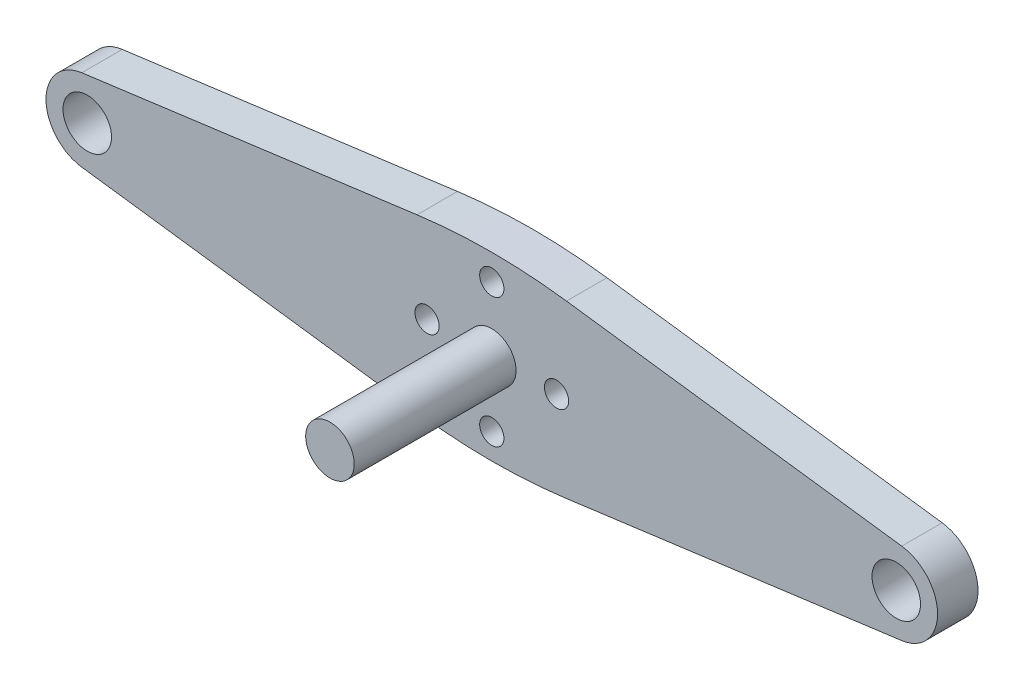
ISO-10303-21;
HEADER;
FILE_DESCRIPTION(('STEP AP214'),'2;1');
FILE_NAME('part.step','',(''),(''),'','','');
FILE_SCHEMA(('AUTOMOTIVE_DESIGN { 1 0 10303 214 1 1 1 1 }'));
ENDSEC;
DATA;
#1=APPLICATION_CONTEXT('core data for automotive mechanical design processes');
#2=APPLICATION_PROTOCOL_DEFINITION('international standard','automotive_design',2000,#1);
#3=PRODUCT_CONTEXT('',#1,'mechanical');
#4=PRODUCT('Part','Part','',(#3));
#5=PRODUCT_RELATED_PRODUCT_CATEGORY('part','',(#4));
#6=PRODUCT_DEFINITION_FORMATION('','',#4);
#7=PRODUCT_DEFINITION_CONTEXT('part definition',#1,'design');
#8=PRODUCT_DEFINITION('design','',#6,#7);
#9=PRODUCT_DEFINITION_SHAPE('','',#8);
#10=(LENGTH_UNIT() NAMED_UNIT(*) SI_UNIT(.MILLI.,.METRE.));
#11=(NAMED_UNIT(*) PLANE_ANGLE_UNIT() SI_UNIT($,.RADIAN.));
#12=(NAMED_UNIT(*) SI_UNIT($,.STERADIAN.) SOLID_ANGLE_UNIT());
#13=UNCERTAINTY_MEASURE_WITH_UNIT(LENGTH_MEASURE(1.E-05),#10,'distance_accuracy_value','');
#14=(GEOMETRIC_REPRESENTATION_CONTEXT(3) GLOBAL_UNCERTAINTY_ASSIGNED_CONTEXT((#13)) GLOBAL_UNIT_ASSIGNED_CONTEXT((#10,
#11,#12)) REPRESENTATION_CONTEXT('',''));
#15=CARTESIAN_POINT('',(0.,0.,0.));
#16=DIRECTION('',(0.,0.,1.));
#17=DIRECTION('',(1.,0.,0.));
#18=AXIS2_PLACEMENT_3D('',#15,#16,#17);
#19=CARTESIAN_POINT('',(50.,0.,5.));
#20=DIRECTION('',(0.,0.,-1.));
#21=DIRECTION('',(-1.,0.,0.));
#22=AXIS2_PLACEMENT_3D('',#19,#20,#21);
#23=PLANE('',#22);
#24=CARTESIAN_POINT('',(50.,0.,5.));
#25=DIRECTION('',(0.,0.,1.));
#26=DIRECTION('',(-1.,0.,0.));
#27=AXIS2_PLACEMENT_3D('',#24,#25,#26);
#28=CIRCLE('',#27,5.10024633771241);
#29=CARTESIAN_POINT('',(50.6728763500851,-5.05566515137672,5.));
#30=VERTEX_POINT('',#29);
#31=CARTESIAN_POINT('',(50.6728763500851,5.05566515137672,5.));
#32=VERTEX_POINT('',#31);
#33=EDGE_CURVE('E146',#30,#32,#28,.T.);
#34=ORIENTED_EDGE('',*,*,#33,.T.);
#35=DIRECTION('',(-0.991259013117456,0.131930166805804,0.));
#36=VECTOR('',#35,1.);
#37=CARTESIAN_POINT('',(50.6728763500851,5.05566515137672,5.));
#38=LINE('',#37,#36);
#39=CARTESIAN_POINT('',(9.2351116764065,10.5707637614413,5.));
#40=VERTEX_POINT('',#39);
#41=EDGE_CURVE('E94',#32,#40,#38,.T.);
#42=ORIENTED_EDGE('',*,*,#41,.T.);
#43=CARTESIAN_POINT('',(0.,-58.8173671567806,5.));
#44=DIRECTION('',(0.,0.,1.));
#45=DIRECTION('',(-1.,0.,0.));
#46=AXIS2_PLACEMENT_3D('',#43,#44,#45);
#47=CIRCLE('',#46,70.);
#48=CARTESIAN_POINT('',(-9.23511167640649,10.5707637614413,5.));
#49=VERTEX_POINT('',#48);
#50=EDGE_CURVE('E161',#40,#49,#47,.T.);
#51=ORIENTED_EDGE('',*,*,#50,.T.);
#52=DIRECTION('',(-0.991259013117456,-0.131930166805804,0.));
#53=VECTOR('',#52,1.);
#54=CARTESIAN_POINT('',(-50.6728763500851,5.05566515137672,5.));
#55=LINE('',#54,#53);
#56=CARTESIAN_POINT('',(-50.6728763500851,5.05566515137672,5.));
#57=VERTEX_POINT('',#56);
#58=EDGE_CURVE('E174',#49,#57,#55,.T.);
#59=ORIENTED_EDGE('',*,*,#58,.T.);
#60=CARTESIAN_POINT('',(-50.,0.,5.));
#61=DIRECTION('',(0.,0.,1.));
#62=DIRECTION('',(1.,0.,0.));
#63=AXIS2_PLACEMENT_3D('',#60,#61,#62);
#64=CIRCLE('',#63,5.10024633771241);
#65=CARTESIAN_POINT('',(-50.6728763500851,-5.05566515137672,5.));
#66=VERTEX_POINT('',#65);
#67=EDGE_CURVE('E113',#57,#66,#64,.T.);
#68=ORIENTED_EDGE('',*,*,#67,.T.);
#69=DIRECTION('',(0.991259013117456,-0.131930166805804,0.));
#70=VECTOR('',#69,1.);
#71=CARTESIAN_POINT('',(-50.6728763500851,-5.05566515137672,5.));
#72=LINE('',#71,#70);
#73=CARTESIAN_POINT('',(-9.23511167640653,-10.5707637614413,5.));
#74=VERTEX_POINT('',#73);
#75=EDGE_CURVE('E107',#66,#74,#72,.T.);
#76=ORIENTED_EDGE('',*,*,#75,.T.);
#77=CARTESIAN_POINT('',(0.,58.8173671567806,5.));
#78=DIRECTION('',(0.,0.,1.));
#79=DIRECTION('',(1.,0.,0.));
#80=AXIS2_PLACEMENT_3D('',#77,#78,#79);
#81=CIRCLE('',#80,70.);
#82=CARTESIAN_POINT('',(9.23511167640649,-10.5707637614413,5.));
#83=VERTEX_POINT('',#82);
#84=EDGE_CURVE('E111',#74,#83,#81,.T.);
#85=ORIENTED_EDGE('',*,*,#84,.T.);
#86=DIRECTION('',(0.991259013117456,0.131930166805804,0.));
#87=VECTOR('',#86,1.);
#88=CARTESIAN_POINT('',(50.6728763500851,-5.05566515137672,5.));
#89=LINE('',#88,#87);
#90=EDGE_CURVE('E51',#83,#30,#89,.T.);
#91=ORIENTED_EDGE('',*,*,#90,.T.);
#92=EDGE_LOOP('',(#34,#42,#51,#59,#68,#76,#85,#91));
#93=FACE_BOUND('',#92,.T.);
#94=CARTESIAN_POINT('',(0.,0.,5.));
#95=DIRECTION('',(0.,0.,1.));
#96=DIRECTION('',(1.,0.,0.));
#97=AXIS2_PLACEMENT_3D('',#94,#95,#96);
#98=CIRCLE('',#97,3.);
#99=CARTESIAN_POINT('',(3.,0.,5.));
#100=VERTEX_POINT('',#99);
#101=EDGE_CURVE('E135',#100,#100,#98,.T.);
#102=ORIENTED_EDGE('',*,*,#101,.F.);
#103=EDGE_LOOP('',(#102));
#104=FACE_BOUND('',#103,.T.);
#105=CARTESIAN_POINT('',(-8.,0.,5.));
#106=DIRECTION('',(0.,0.,1.));
#107=DIRECTION('',(1.,0.,0.));
#108=AXIS2_PLACEMENT_3D('',#105,#106,#107);
#109=CIRCLE('',#108,1.5);
#110=CARTESIAN_POINT('',(-6.5,0.,5.));
#111=VERTEX_POINT('',#110);
#112=EDGE_CURVE('E182',#111,#111,#109,.T.);
#113=ORIENTED_EDGE('',*,*,#112,.F.);
#114=EDGE_LOOP('',(#113));
#115=FACE_BOUND('',#114,.T.);
#116=CARTESIAN_POINT('',(-50.,0.,5.));
#117=DIRECTION('',(0.,0.,1.));
#118=DIRECTION('',(1.,0.,0.));
#119=AXIS2_PLACEMENT_3D('',#116,#117,#118);
#120=CIRCLE('',#119,3.);
#121=CARTESIAN_POINT('',(-47.,0.,5.));
#122=VERTEX_POINT('',#121);
#123=EDGE_CURVE('E186',#122,#122,#120,.T.);
#124=ORIENTED_EDGE('',*,*,#123,.F.);
#125=EDGE_LOOP('',(#124));
#126=FACE_BOUND('',#125,.T.);
#127=CARTESIAN_POINT('',(0.,8.,5.));
#128=DIRECTION('',(0.,0.,1.));
#129=DIRECTION('',(1.,0.,0.));
#130=AXIS2_PLACEMENT_3D('',#127,#128,#129);
#131=CIRCLE('',#130,1.5);
#132=CARTESIAN_POINT('',(1.5,8.,5.));
#133=VERTEX_POINT('',#132);
#134=EDGE_CURVE('E192',#133,#133,#131,.T.);
#135=ORIENTED_EDGE('',*,*,#134,.F.);
#136=EDGE_LOOP('',(#135));
#137=FACE_BOUND('',#136,.T.);
#138=CARTESIAN_POINT('',(8.,0.,5.));
#139=DIRECTION('',(0.,0.,1.));
#140=DIRECTION('',(1.,0.,0.));
#141=AXIS2_PLACEMENT_3D('',#138,#139,#140);
#142=CIRCLE('',#141,1.5);
#143=CARTESIAN_POINT('',(9.49999999999999,0.,5.));
#144=VERTEX_POINT('',#143);
#145=EDGE_CURVE('E198',#144,#144,#142,.T.);
#146=ORIENTED_EDGE('',*,*,#145,.F.);
#147=EDGE_LOOP('',(#146));
#148=FACE_BOUND('',#147,.T.);
#149=CARTESIAN_POINT('',(0.,-8.,5.));
#150=DIRECTION('',(0.,0.,1.));
#151=DIRECTION('',(1.,0.,0.));
#152=AXIS2_PLACEMENT_3D('',#149,#150,#151);
#153=CIRCLE('',#152,1.5);
#154=CARTESIAN_POINT('',(1.5,-8.,5.));
#155=VERTEX_POINT('',#154);
#156=EDGE_CURVE('E204',#155,#155,#153,.T.);
#157=ORIENTED_EDGE('',*,*,#156,.F.);
#158=EDGE_LOOP('',(#157));
#159=FACE_BOUND('',#158,.T.);
#160=CARTESIAN_POINT('',(50.,0.,5.));
#161=DIRECTION('',(0.,0.,1.));
#162=DIRECTION('',(-1.,0.,0.));
#163=AXIS2_PLACEMENT_3D('',#160,#161,#162);
#164=CIRCLE('',#163,3.);
#165=CARTESIAN_POINT('',(47.,0.,5.));
#166=VERTEX_POINT('',#165);
#167=EDGE_CURVE('E210',#166,#166,#164,.T.);
#168=ORIENTED_EDGE('',*,*,#167,.F.);
#169=EDGE_LOOP('',(#168));
#170=FACE_BOUND('',#169,.T.);
#171=ADVANCED_FACE('F34',(#93,#104,#115,#126,#137,#148,#159,#170),#23,.F.);
#172=CARTESIAN_POINT('',(50.,0.,0.));
#173=DIRECTION('',(0.,0.,-1.));
#174=DIRECTION('',(-1.,0.,0.));
#175=AXIS2_PLACEMENT_3D('',#172,#173,#174);
#176=PLANE('',#175);
#177=CARTESIAN_POINT('',(0.,-8.,0.));
#178=DIRECTION('',(0.,0.,1.));
#179=DIRECTION('',(1.,0.,0.));
#180=AXIS2_PLACEMENT_3D('',#177,#178,#179);
#181=CIRCLE('',#180,1.5);
#182=CARTESIAN_POINT('',(1.5,-8.,0.));
#183=VERTEX_POINT('',#182);
#184=EDGE_CURVE('E207',#183,#183,#181,.T.);
#185=ORIENTED_EDGE('',*,*,#184,.T.);
#186=EDGE_LOOP('',(#185));
#187=FACE_BOUND('',#186,.T.);
#188=CARTESIAN_POINT('',(0.,8.,0.));
#189=DIRECTION('',(0.,0.,1.));
#190=DIRECTION('',(1.,0.,0.));
#191=AXIS2_PLACEMENT_3D('',#188,#189,#190);
#192=CIRCLE('',#191,1.5);
#193=CARTESIAN_POINT('',(1.5,8.,0.));
#194=VERTEX_POINT('',#193);
#195=EDGE_CURVE('E195',#194,#194,#192,.T.);
#196=ORIENTED_EDGE('',*,*,#195,.T.);
#197=EDGE_LOOP('',(#196));
#198=FACE_BOUND('',#197,.T.);
#199=CARTESIAN_POINT('',(-8.,0.,0.));
#200=DIRECTION('',(0.,0.,1.));
#201=DIRECTION('',(1.,0.,0.));
#202=AXIS2_PLACEMENT_3D('',#199,#200,#201);
#203=CIRCLE('',#202,1.5);
#204=CARTESIAN_POINT('',(-6.5,0.,0.));
#205=VERTEX_POINT('',#204);
#206=EDGE_CURVE('E183',#205,#205,#203,.T.);
#207=ORIENTED_EDGE('',*,*,#206,.T.);
#208=EDGE_LOOP('',(#207));
#209=FACE_BOUND('',#208,.T.);
#210=CARTESIAN_POINT('',(50.,0.,0.));
#211=DIRECTION('',(0.,0.,1.));
#212=DIRECTION('',(-1.,0.,0.));
#213=AXIS2_PLACEMENT_3D('',#210,#211,#212);
#214=CIRCLE('',#213,5.10024633771241);
#215=CARTESIAN_POINT('',(50.6728763500851,-5.05566515137672,0.));
#216=VERTEX_POINT('',#215);
#217=CARTESIAN_POINT('',(50.6728763500851,5.05566515137672,0.));
#218=VERTEX_POINT('',#217);
#219=EDGE_CURVE('E131',#216,#218,#214,.T.);
#220=ORIENTED_EDGE('',*,*,#219,.F.);
#221=DIRECTION('',(0.991259013117456,0.131930166805804,0.));
#222=VECTOR('',#221,1.);
#223=CARTESIAN_POINT('',(50.6728763500851,-5.05566515137672,0.));
#224=LINE('',#223,#222);
#225=CARTESIAN_POINT('',(9.23511167640649,-10.5707637614413,0.));
#226=VERTEX_POINT('',#225);
#227=EDGE_CURVE('E86',#226,#216,#224,.T.);
#228=ORIENTED_EDGE('',*,*,#227,.F.);
#229=CARTESIAN_POINT('',(0.,58.8173671567806,0.));
#230=DIRECTION('',(0.,0.,1.));
#231=DIRECTION('',(1.,0.,0.));
#232=AXIS2_PLACEMENT_3D('',#229,#230,#231);
#233=CIRCLE('',#232,70.);
#234=CARTESIAN_POINT('',(-9.23511167640653,-10.5707637614413,0.));
#235=VERTEX_POINT('',#234);
#236=EDGE_CURVE('E80',#235,#226,#233,.T.);
#237=ORIENTED_EDGE('',*,*,#236,.F.);
#238=DIRECTION('',(0.991259013117456,-0.131930166805804,0.));
#239=VECTOR('',#238,1.);
#240=CARTESIAN_POINT('',(-50.6728763500851,-5.05566515137672,0.));
#241=LINE('',#240,#239);
#242=CARTESIAN_POINT('',(-50.6728763500851,-5.05566515137672,0.));
#243=VERTEX_POINT('',#242);
#244=EDGE_CURVE('E121',#243,#235,#241,.T.);
#245=ORIENTED_EDGE('',*,*,#244,.F.);
#246=CARTESIAN_POINT('',(-50.,0.,0.));
#247=DIRECTION('',(0.,0.,1.));
#248=DIRECTION('',(1.,0.,0.));
#249=AXIS2_PLACEMENT_3D('',#246,#247,#248);
#250=CIRCLE('',#249,5.10024633771241);
#251=CARTESIAN_POINT('',(-50.6728763500851,5.05566515137672,0.));
#252=VERTEX_POINT('',#251);
#253=EDGE_CURVE('E141',#252,#243,#250,.T.);
#254=ORIENTED_EDGE('',*,*,#253,.F.);
#255=DIRECTION('',(-0.991259013117456,-0.131930166805804,0.));
#256=VECTOR('',#255,1.);
#257=CARTESIAN_POINT('',(-50.6728763500851,5.05566515137672,0.));
#258=LINE('',#257,#256);
#259=CARTESIAN_POINT('',(-9.23511167640649,10.5707637614413,0.));
#260=VERTEX_POINT('',#259);
#261=EDGE_CURVE('E139',#260,#252,#258,.T.);
#262=ORIENTED_EDGE('',*,*,#261,.F.);
#263=CARTESIAN_POINT('',(0.,-58.8173671567806,0.));
#264=DIRECTION('',(0.,0.,1.));
#265=DIRECTION('',(-1.,0.,0.));
#266=AXIS2_PLACEMENT_3D('',#263,#264,#265);
#267=CIRCLE('',#266,70.);
#268=CARTESIAN_POINT('',(9.2351116764065,10.5707637614413,0.));
#269=VERTEX_POINT('',#268);
#270=EDGE_CURVE('E137',#269,#260,#267,.T.);
#271=ORIENTED_EDGE('',*,*,#270,.F.);
#272=DIRECTION('',(-0.991259013117456,0.131930166805804,0.));
#273=VECTOR('',#272,1.);
#274=CARTESIAN_POINT('',(50.6728763500851,5.05566515137672,0.));
#275=LINE('',#274,#273);
#276=EDGE_CURVE('E134',#218,#269,#275,.T.);
#277=ORIENTED_EDGE('',*,*,#276,.F.);
#278=EDGE_LOOP('',(#220,#228,#237,#245,#254,#262,#271,#277));
#279=FACE_BOUND('',#278,.T.);
#280=CARTESIAN_POINT('',(-50.,0.,0.));
#281=DIRECTION('',(0.,0.,1.));
#282=DIRECTION('',(1.,0.,0.));
#283=AXIS2_PLACEMENT_3D('',#280,#281,#282);
#284=CIRCLE('',#283,3.);
#285=CARTESIAN_POINT('',(-47.,0.,0.));
#286=VERTEX_POINT('',#285);
#287=EDGE_CURVE('E189',#286,#286,#284,.T.);
#288=ORIENTED_EDGE('',*,*,#287,.T.);
#289=EDGE_LOOP('',(#288));
#290=FACE_BOUND('',#289,.T.);
#291=CARTESIAN_POINT('',(8.,0.,0.));
#292=DIRECTION('',(0.,0.,1.));
#293=DIRECTION('',(1.,0.,0.));
#294=AXIS2_PLACEMENT_3D('',#291,#292,#293);
#295=CIRCLE('',#294,1.5);
#296=CARTESIAN_POINT('',(9.49999999999999,0.,0.));
#297=VERTEX_POINT('',#296);
#298=EDGE_CURVE('E201',#297,#297,#295,.T.);
#299=ORIENTED_EDGE('',*,*,#298,.T.);
#300=EDGE_LOOP('',(#299));
#301=FACE_BOUND('',#300,.T.);
#302=CARTESIAN_POINT('',(50.,0.,0.));
#303=DIRECTION('',(0.,0.,1.));
#304=DIRECTION('',(-1.,0.,0.));
#305=AXIS2_PLACEMENT_3D('',#302,#303,#304);
#306=CIRCLE('',#305,3.);
#307=CARTESIAN_POINT('',(47.,0.,0.));
#308=VERTEX_POINT('',#307);
#309=EDGE_CURVE('E213',#308,#308,#306,.T.);
#310=ORIENTED_EDGE('',*,*,#309,.T.);
#311=EDGE_LOOP('',(#310));
#312=FACE_BOUND('',#311,.T.);
#313=ADVANCED_FACE('F165',(#187,#198,#209,#279,#290,#301,#312),#176,.T.);
#314=CARTESIAN_POINT('',(50.,0.,5.));
#315=DIRECTION('',(0.,0.,-1.));
#316=DIRECTION('',(-1.,0.,0.));
#317=AXIS2_PLACEMENT_3D('',#314,#315,#316);
#318=CYLINDRICAL_SURFACE('',#317,5.10024633771241);
#319=ORIENTED_EDGE('',*,*,#219,.T.);
#320=DIRECTION('',(0.,0.,-1.));
#321=VECTOR('',#320,1.);
#322=CARTESIAN_POINT('',(50.6728763500851,5.05566515137672,5.));
#323=LINE('',#322,#321);
#324=EDGE_CURVE('E11',#32,#218,#323,.T.);
#325=ORIENTED_EDGE('',*,*,#324,.F.);
#326=ORIENTED_EDGE('',*,*,#33,.F.);
#327=DIRECTION('',(0.,0.,-1.));
#328=VECTOR('',#327,1.);
#329=CARTESIAN_POINT('',(50.6728763500851,-5.05566515137672,5.));
#330=LINE('',#329,#328);
#331=EDGE_CURVE('E127',#30,#216,#330,.T.);
#332=ORIENTED_EDGE('',*,*,#331,.T.);
#333=EDGE_LOOP('',(#319,#325,#326,#332));
#334=FACE_BOUND('',#333,.T.);
#335=ADVANCED_FACE('F36',(#334),#318,.T.);
#336=CARTESIAN_POINT('',(50.6728763500851,5.05566515137672,5.));
#337=DIRECTION('',(-0.131930166805804,-0.991259013117456,0.));
#338=DIRECTION('',(0.991259013117456,-0.131930166805804,0.));
#339=AXIS2_PLACEMENT_3D('',#336,#337,#338);
#340=PLANE('',#339);
#341=ORIENTED_EDGE('',*,*,#276,.T.);
#342=DIRECTION('',(0.,0.,-1.));
#343=VECTOR('',#342,1.);
#344=CARTESIAN_POINT('',(9.2351116764065,10.5707637614413,5.));
#345=LINE('',#344,#343);
#346=EDGE_CURVE('E43',#40,#269,#345,.T.);
#347=ORIENTED_EDGE('',*,*,#346,.F.);
#348=ORIENTED_EDGE('',*,*,#41,.F.);
#349=ORIENTED_EDGE('',*,*,#324,.T.);
#350=EDGE_LOOP('',(#341,#347,#348,#349));
#351=FACE_BOUND('',#350,.T.);
#352=ADVANCED_FACE('F257',(#351),#340,.F.);
#353=CARTESIAN_POINT('',(0.,-58.8173671567806,5.));
#354=DIRECTION('',(0.,0.,-1.));
#355=DIRECTION('',(-1.,0.,0.));
#356=AXIS2_PLACEMENT_3D('',#353,#354,#355);
#357=CYLINDRICAL_SURFACE('',#356,70.);
#358=ORIENTED_EDGE('',*,*,#270,.T.);
#359=DIRECTION('',(0.,0.,-1.));
#360=VECTOR('',#359,1.);
#361=CARTESIAN_POINT('',(-9.23511167640649,10.5707637614413,5.));
#362=LINE('',#361,#360);
#363=EDGE_CURVE('E153',#49,#260,#362,.T.);
#364=ORIENTED_EDGE('',*,*,#363,.F.);
#365=ORIENTED_EDGE('',*,*,#50,.F.);
#366=ORIENTED_EDGE('',*,*,#346,.T.);
#367=EDGE_LOOP('',(#358,#364,#365,#366));
#368=FACE_BOUND('',#367,.T.);
#369=ADVANCED_FACE('F159',(#368),#357,.T.);
#370=CARTESIAN_POINT('',(-50.6728763500851,5.05566515137672,5.));
#371=DIRECTION('',(0.131930166805804,-0.991259013117456,0.));
#372=DIRECTION('',(0.991259013117456,0.131930166805804,0.));
#373=AXIS2_PLACEMENT_3D('',#370,#371,#372);
#374=PLANE('',#373);
#375=ORIENTED_EDGE('',*,*,#261,.T.);
#376=DIRECTION('',(0.,0.,-1.));
#377=VECTOR('',#376,1.);
#378=CARTESIAN_POINT('',(-50.6728763500851,5.05566515137672,5.));
#379=LINE('',#378,#377);
#380=EDGE_CURVE('E150',#57,#252,#379,.T.);
#381=ORIENTED_EDGE('',*,*,#380,.F.);
#382=ORIENTED_EDGE('',*,*,#58,.F.);
#383=ORIENTED_EDGE('',*,*,#363,.T.);
#384=EDGE_LOOP('',(#375,#381,#382,#383));
#385=FACE_BOUND('',#384,.T.);
#386=ADVANCED_FACE('F170',(#385),#374,.F.);
#387=CARTESIAN_POINT('',(-50.,0.,5.));
#388=DIRECTION('',(0.,0.,-1.));
#389=DIRECTION('',(-1.,0.,0.));
#390=AXIS2_PLACEMENT_3D('',#387,#388,#389);
#391=CYLINDRICAL_SURFACE('',#390,5.10024633771241);
#392=ORIENTED_EDGE('',*,*,#253,.T.);
#393=DIRECTION('',(0.,0.,-1.));
#394=VECTOR('',#393,1.);
#395=CARTESIAN_POINT('',(-50.6728763500851,-5.05566515137672,5.));
#396=LINE('',#395,#394);
#397=EDGE_CURVE('E122',#66,#243,#396,.T.);
#398=ORIENTED_EDGE('',*,*,#397,.F.);
#399=ORIENTED_EDGE('',*,*,#67,.F.);
#400=ORIENTED_EDGE('',*,*,#380,.T.);
#401=EDGE_LOOP('',(#392,#398,#399,#400));
#402=FACE_BOUND('',#401,.T.);
#403=ADVANCED_FACE('F173',(#402),#391,.T.);
#404=CARTESIAN_POINT('',(-50.6728763500851,-5.05566515137672,5.));
#405=DIRECTION('',(0.131930166805804,0.991259013117456,0.));
#406=DIRECTION('',(-0.991259013117456,0.131930166805804,0.));
#407=AXIS2_PLACEMENT_3D('',#404,#405,#406);
#408=PLANE('',#407);
#409=ORIENTED_EDGE('',*,*,#244,.T.);
#410=DIRECTION('',(0.,0.,-1.));
#411=VECTOR('',#410,1.);
#412=CARTESIAN_POINT('',(-9.23511167640653,-10.5707637614413,5.));
#413=LINE('',#412,#411);
#414=EDGE_CURVE('E118',#74,#235,#413,.T.);
#415=ORIENTED_EDGE('',*,*,#414,.F.);
#416=ORIENTED_EDGE('',*,*,#75,.F.);
#417=ORIENTED_EDGE('',*,*,#397,.T.);
#418=EDGE_LOOP('',(#409,#415,#416,#417));
#419=FACE_BOUND('',#418,.T.);
#420=ADVANCED_FACE('F119',(#419),#408,.F.);
#421=CARTESIAN_POINT('',(0.,58.8173671567806,5.));
#422=DIRECTION('',(0.,0.,-1.));
#423=DIRECTION('',(-1.,0.,0.));
#424=AXIS2_PLACEMENT_3D('',#421,#422,#423);
#425=CYLINDRICAL_SURFACE('',#424,70.);
#426=ORIENTED_EDGE('',*,*,#236,.T.);
#427=DIRECTION('',(0.,0.,-1.));
#428=VECTOR('',#427,1.);
#429=CARTESIAN_POINT('',(9.23511167640649,-10.5707637614413,5.));
#430=LINE('',#429,#428);
#431=EDGE_CURVE('E123',#83,#226,#430,.T.);
#432=ORIENTED_EDGE('',*,*,#431,.F.);
#433=ORIENTED_EDGE('',*,*,#84,.F.);
#434=ORIENTED_EDGE('',*,*,#414,.T.);
#435=EDGE_LOOP('',(#426,#432,#433,#434));
#436=FACE_BOUND('',#435,.T.);
#437=ADVANCED_FACE('F125',(#436),#425,.T.);
#438=CARTESIAN_POINT('',(50.6728763500851,-5.05566515137672,5.));
#439=DIRECTION('',(-0.131930166805804,0.991259013117456,0.));
#440=DIRECTION('',(-0.991259013117456,-0.131930166805804,0.));
#441=AXIS2_PLACEMENT_3D('',#438,#439,#440);
#442=PLANE('',#441);
#443=ORIENTED_EDGE('',*,*,#227,.T.);
#444=ORIENTED_EDGE('',*,*,#331,.F.);
#445=ORIENTED_EDGE('',*,*,#90,.F.);
#446=ORIENTED_EDGE('',*,*,#431,.T.);
#447=EDGE_LOOP('',(#443,#444,#445,#446));
#448=FACE_BOUND('',#447,.T.);
#449=ADVANCED_FACE('F262',(#448),#442,.F.);
#450=CARTESIAN_POINT('',(-8.,0.,5.));
#451=DIRECTION('',(0.,0.,-1.));
#452=DIRECTION('',(-1.,0.,0.));
#453=AXIS2_PLACEMENT_3D('',#450,#451,#452);
#454=CYLINDRICAL_SURFACE('',#453,1.5);
#455=ORIENTED_EDGE('',*,*,#112,.T.);
#456=EDGE_LOOP('',(#455));
#457=FACE_BOUND('',#456,.T.);
#458=ORIENTED_EDGE('',*,*,#206,.F.);
#459=EDGE_LOOP('',(#458));
#460=FACE_BOUND('',#459,.T.);
#461=ADVANCED_FACE('F265',(#457,#460),#454,.F.);
#462=CARTESIAN_POINT('',(-50.,0.,5.));
#463=DIRECTION('',(0.,0.,-1.));
#464=DIRECTION('',(-1.,0.,0.));
#465=AXIS2_PLACEMENT_3D('',#462,#463,#464);
#466=CYLINDRICAL_SURFACE('',#465,3.);
#467=ORIENTED_EDGE('',*,*,#123,.T.);
#468=EDGE_LOOP('',(#467));
#469=FACE_BOUND('',#468,.T.);
#470=ORIENTED_EDGE('',*,*,#287,.F.);
#471=EDGE_LOOP('',(#470));
#472=FACE_BOUND('',#471,.T.);
#473=ADVANCED_FACE('F312',(#469,#472),#466,.F.);
#474=CARTESIAN_POINT('',(0.,8.,5.));
#475=DIRECTION('',(0.,0.,-1.));
#476=DIRECTION('',(-1.,0.,0.));
#477=AXIS2_PLACEMENT_3D('',#474,#475,#476);
#478=CYLINDRICAL_SURFACE('',#477,1.5);
#479=ORIENTED_EDGE('',*,*,#134,.T.);
#480=EDGE_LOOP('',(#479));
#481=FACE_BOUND('',#480,.T.);
#482=ORIENTED_EDGE('',*,*,#195,.F.);
#483=EDGE_LOOP('',(#482));
#484=FACE_BOUND('',#483,.T.);
#485=ADVANCED_FACE('F319',(#481,#484),#478,.F.);
#486=CARTESIAN_POINT('',(8.,0.,5.));
#487=DIRECTION('',(0.,0.,-1.));
#488=DIRECTION('',(-1.,0.,0.));
#489=AXIS2_PLACEMENT_3D('',#486,#487,#488);
#490=CYLINDRICAL_SURFACE('',#489,1.5);
#491=ORIENTED_EDGE('',*,*,#145,.T.);
#492=EDGE_LOOP('',(#491));
#493=FACE_BOUND('',#492,.T.);
#494=ORIENTED_EDGE('',*,*,#298,.F.);
#495=EDGE_LOOP('',(#494));
#496=FACE_BOUND('',#495,.T.);
#497=ADVANCED_FACE('F327',(#493,#496),#490,.F.);
#498=CARTESIAN_POINT('',(0.,-8.,5.));
#499=DIRECTION('',(0.,0.,-1.));
#500=DIRECTION('',(-1.,0.,0.));
#501=AXIS2_PLACEMENT_3D('',#498,#499,#500);
#502=CYLINDRICAL_SURFACE('',#501,1.5);
#503=ORIENTED_EDGE('',*,*,#156,.T.);
#504=EDGE_LOOP('',(#503));
#505=FACE_BOUND('',#504,.T.);
#506=ORIENTED_EDGE('',*,*,#184,.F.);
#507=EDGE_LOOP('',(#506));
#508=FACE_BOUND('',#507,.T.);
#509=ADVANCED_FACE('F247',(#505,#508),#502,.F.);
#510=CARTESIAN_POINT('',(50.,0.,5.));
#511=DIRECTION('',(0.,0.,-1.));
#512=DIRECTION('',(-1.,0.,0.));
#513=AXIS2_PLACEMENT_3D('',#510,#511,#512);
#514=CYLINDRICAL_SURFACE('',#513,3.);
#515=ORIENTED_EDGE('',*,*,#167,.T.);
#516=EDGE_LOOP('',(#515));
#517=FACE_BOUND('',#516,.T.);
#518=ORIENTED_EDGE('',*,*,#309,.F.);
#519=EDGE_LOOP('',(#518));
#520=FACE_BOUND('',#519,.T.);
#521=ADVANCED_FACE('F227',(#517,#520),#514,.F.);
#522=CARTESIAN_POINT('',(0.,0.,25.));
#523=DIRECTION('',(0.,0.,-1.));
#524=DIRECTION('',(-1.,0.,0.));
#525=AXIS2_PLACEMENT_3D('',#522,#523,#524);
#526=CYLINDRICAL_SURFACE('',#525,3.);
#527=CARTESIAN_POINT('',(0.,0.,25.));
#528=DIRECTION('',(0.,0.,1.));
#529=DIRECTION('',(1.,0.,0.));
#530=AXIS2_PLACEMENT_3D('',#527,#528,#529);
#531=CIRCLE('',#530,3.);
#532=CARTESIAN_POINT('',(3.,0.,25.));
#533=VERTEX_POINT('',#532);
#534=EDGE_CURVE('E216',#533,#533,#531,.T.);
#535=ORIENTED_EDGE('',*,*,#534,.F.);
#536=EDGE_LOOP('',(#535));
#537=FACE_BOUND('',#536,.T.);
#538=ORIENTED_EDGE('',*,*,#101,.T.);
#539=EDGE_LOOP('',(#538));
#540=FACE_BOUND('',#539,.T.);
#541=ADVANCED_FACE('F224',(#537,#540),#526,.T.);
#542=CARTESIAN_POINT('',(0.,0.,25.));
#543=DIRECTION('',(0.,0.,1.));
#544=DIRECTION('',(1.,0.,0.));
#545=AXIS2_PLACEMENT_3D('',#542,#543,#544);
#546=PLANE('',#545);
#547=ORIENTED_EDGE('',*,*,#534,.T.);
#548=EDGE_LOOP('',(#547));
#549=FACE_BOUND('',#548,.T.);
#550=ADVANCED_FACE('F222',(#549),#546,.T.);
#551=CLOSED_SHELL('',(#171,#313,#335,#352,#369,#386,#403,#420,#437,#449,#461,#473,#485,#497,
#509,#521,#541,#550));
#552=MANIFOLD_SOLID_BREP('B2',#551);
#553=ADVANCED_BREP_SHAPE_REPRESENTATION('',(#18,#552),#14);
#554=SHAPE_DEFINITION_REPRESENTATION(#9,#553);
ENDSEC;
END-ISO-10303-21;
